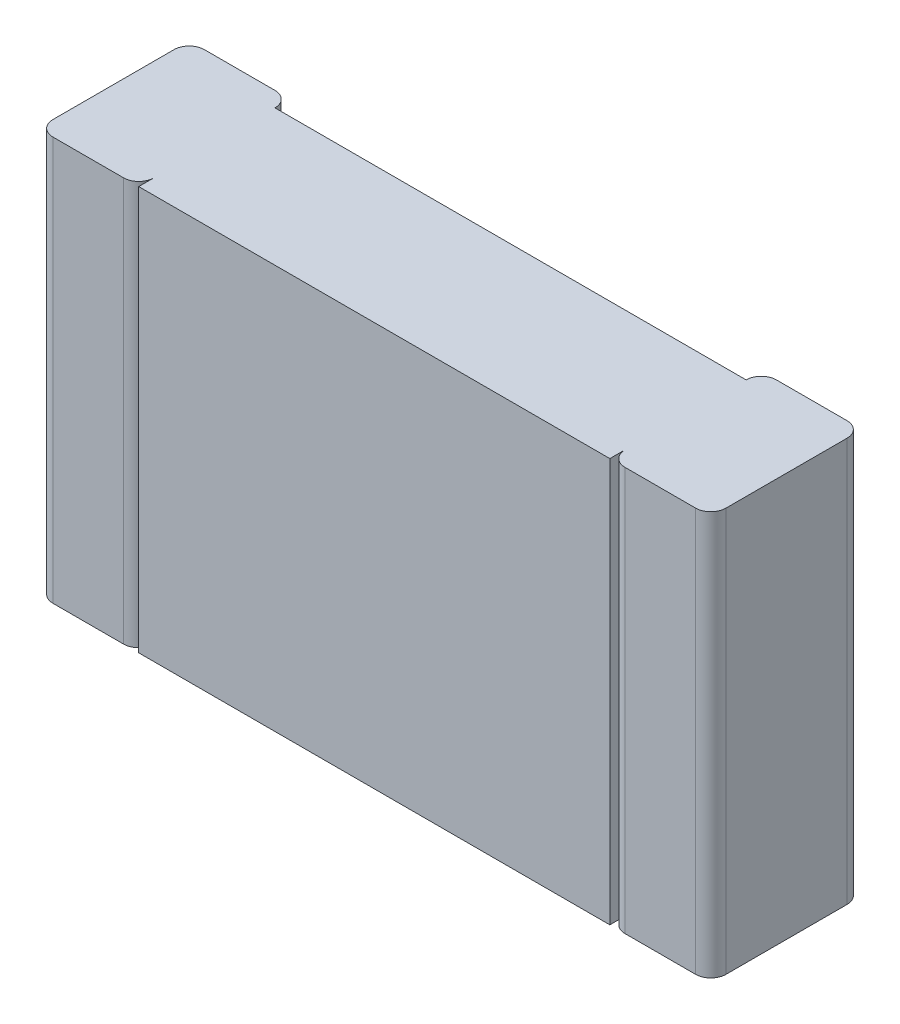
ISO-10303-21;
HEADER;
FILE_DESCRIPTION(('STEP AP214'),'2;1');
FILE_NAME('part.step','',(''),(''),'','','');
FILE_SCHEMA(('AUTOMOTIVE_DESIGN { 1 0 10303 214 1 1 1 1 }'));
ENDSEC;
DATA;
#1=APPLICATION_CONTEXT('core data for automotive mechanical design processes');
#2=APPLICATION_PROTOCOL_DEFINITION('international standard','automotive_design',2000,#1);
#3=PRODUCT_CONTEXT('',#1,'mechanical');
#4=PRODUCT('Part','Part','',(#3));
#5=PRODUCT_RELATED_PRODUCT_CATEGORY('part','',(#4));
#6=PRODUCT_DEFINITION_FORMATION('','',#4);
#7=PRODUCT_DEFINITION_CONTEXT('part definition',#1,'design');
#8=PRODUCT_DEFINITION('design','',#6,#7);
#9=PRODUCT_DEFINITION_SHAPE('','',#8);
#10=(LENGTH_UNIT() NAMED_UNIT(*) SI_UNIT(.MILLI.,.METRE.));
#11=(NAMED_UNIT(*) PLANE_ANGLE_UNIT() SI_UNIT($,.RADIAN.));
#12=(NAMED_UNIT(*) SI_UNIT($,.STERADIAN.) SOLID_ANGLE_UNIT());
#13=UNCERTAINTY_MEASURE_WITH_UNIT(LENGTH_MEASURE(1.E-05),#10,'distance_accuracy_value','');
#14=(GEOMETRIC_REPRESENTATION_CONTEXT(3) GLOBAL_UNCERTAINTY_ASSIGNED_CONTEXT((#13)) GLOBAL_UNIT_ASSIGNED_CONTEXT((#10,
#11,#12)) REPRESENTATION_CONTEXT('',''));
#15=CARTESIAN_POINT('',(0.,0.,0.));
#16=DIRECTION('',(0.,0.,1.));
#17=DIRECTION('',(1.,0.,0.));
#18=AXIS2_PLACEMENT_3D('',#15,#16,#17);
#19=CARTESIAN_POINT('',(-0.955,-0.6,0.045));
#20=DIRECTION('',(0.,1.,0.));
#21=DIRECTION('',(0.,0.,1.));
#22=AXIS2_PLACEMENT_3D('',#19,#20,#21);
#23=CYLINDRICAL_SURFACE('',#22,0.045);
#24=DIRECTION('',(0.,1.,0.));
#25=VECTOR('',#24,1.);
#26=CARTESIAN_POINT('',(-0.955,-0.6,0.));
#27=LINE('',#26,#25);
#28=CARTESIAN_POINT('',(-0.955,0.6,0.));
#29=VERTEX_POINT('',#28);
#30=CARTESIAN_POINT('',(-0.955,-0.6,0.));
#31=VERTEX_POINT('',#30);
#32=EDGE_CURVE('E128',#29,#31,#27,.F.);
#33=ORIENTED_EDGE('',*,*,#32,.T.);
#34=CARTESIAN_POINT('',(-0.955,-0.6,0.045));
#35=DIRECTION('',(0.,1.,0.));
#36=DIRECTION('',(0.,0.,1.));
#37=AXIS2_PLACEMENT_3D('',#34,#35,#36);
#38=CIRCLE('',#37,0.045);
#39=CARTESIAN_POINT('',(-1.,-0.6,0.045));
#40=VERTEX_POINT('',#39);
#41=EDGE_CURVE('E19',#31,#40,#38,.T.);
#42=ORIENTED_EDGE('',*,*,#41,.T.);
#43=DIRECTION('',(0.,1.,0.));
#44=VECTOR('',#43,1.);
#45=CARTESIAN_POINT('',(-1.,-0.6,0.045));
#46=LINE('',#45,#44);
#47=CARTESIAN_POINT('',(-1.,0.6,0.045));
#48=VERTEX_POINT('',#47);
#49=EDGE_CURVE('E135',#40,#48,#46,.T.);
#50=ORIENTED_EDGE('',*,*,#49,.T.);
#51=CARTESIAN_POINT('',(-0.955,0.6,0.045));
#52=DIRECTION('',(0.,1.,0.));
#53=DIRECTION('',(0.,0.,1.));
#54=AXIS2_PLACEMENT_3D('',#51,#52,#53);
#55=CIRCLE('',#54,0.045);
#56=EDGE_CURVE('E231',#29,#48,#55,.T.);
#57=ORIENTED_EDGE('',*,*,#56,.F.);
#58=EDGE_LOOP('',(#33,#42,#50,#57));
#59=FACE_BOUND('',#58,.T.);
#60=ADVANCED_FACE('F16',(#59),#23,.T.);
#61=CARTESIAN_POINT('',(-1.,-0.6,0.));
#62=DIRECTION('',(1.,0.,0.));
#63=DIRECTION('',(0.,0.,-1.));
#64=AXIS2_PLACEMENT_3D('',#61,#62,#63);
#65=PLANE('',#64);
#66=DIRECTION('',(0.,0.,1.));
#67=VECTOR('',#66,1.);
#68=CARTESIAN_POINT('',(-1.,0.6,0.));
#69=LINE('',#68,#67);
#70=CARTESIAN_POINT('',(-1.,0.6,0.405));
#71=VERTEX_POINT('',#70);
#72=EDGE_CURVE('E140',#48,#71,#69,.T.);
#73=ORIENTED_EDGE('',*,*,#72,.F.);
#74=ORIENTED_EDGE('',*,*,#49,.F.);
#75=DIRECTION('',(0.,0.,1.));
#76=VECTOR('',#75,1.);
#77=CARTESIAN_POINT('',(-1.,-0.6,0.));
#78=LINE('',#77,#76);
#79=CARTESIAN_POINT('',(-1.,-0.6,0.405));
#80=VERTEX_POINT('',#79);
#81=EDGE_CURVE('E139',#40,#80,#78,.T.);
#82=ORIENTED_EDGE('',*,*,#81,.T.);
#83=DIRECTION('',(0.,1.,0.));
#84=VECTOR('',#83,1.);
#85=CARTESIAN_POINT('',(-1.,-0.6,0.405));
#86=LINE('',#85,#84);
#87=EDGE_CURVE('E141',#71,#80,#86,.F.);
#88=ORIENTED_EDGE('',*,*,#87,.F.);
#89=EDGE_LOOP('',(#73,#74,#82,#88));
#90=FACE_BOUND('',#89,.T.);
#91=ADVANCED_FACE('F137',(#90),#65,.F.);
#92=CARTESIAN_POINT('',(-0.955,-0.6,0.405));
#93=DIRECTION('',(0.,1.,0.));
#94=DIRECTION('',(0.,0.,1.));
#95=AXIS2_PLACEMENT_3D('',#92,#93,#94);
#96=CYLINDRICAL_SURFACE('',#95,0.045);
#97=CARTESIAN_POINT('',(-0.955,0.6,0.405));
#98=DIRECTION('',(0.,1.,0.));
#99=DIRECTION('',(0.,0.,1.));
#100=AXIS2_PLACEMENT_3D('',#97,#98,#99);
#101=CIRCLE('',#100,0.045);
#102=CARTESIAN_POINT('',(-0.955,0.6,0.45));
#103=VERTEX_POINT('',#102);
#104=EDGE_CURVE('E229',#71,#103,#101,.T.);
#105=ORIENTED_EDGE('',*,*,#104,.F.);
#106=ORIENTED_EDGE('',*,*,#87,.T.);
#107=CARTESIAN_POINT('',(-0.955,-0.6,0.405));
#108=DIRECTION('',(0.,1.,0.));
#109=DIRECTION('',(0.,0.,1.));
#110=AXIS2_PLACEMENT_3D('',#107,#108,#109);
#111=CIRCLE('',#110,0.045);
#112=CARTESIAN_POINT('',(-0.955,-0.6,0.45));
#113=VERTEX_POINT('',#112);
#114=EDGE_CURVE('E150',#80,#113,#111,.T.);
#115=ORIENTED_EDGE('',*,*,#114,.T.);
#116=DIRECTION('',(0.,1.,0.));
#117=VECTOR('',#116,1.);
#118=CARTESIAN_POINT('',(-0.955,-0.6,0.45));
#119=LINE('',#118,#117);
#120=EDGE_CURVE('E199',#103,#113,#119,.F.);
#121=ORIENTED_EDGE('',*,*,#120,.F.);
#122=EDGE_LOOP('',(#105,#106,#115,#121));
#123=FACE_BOUND('',#122,.T.);
#124=ADVANCED_FACE('F457',(#123),#96,.T.);
#125=CARTESIAN_POINT('',(-1.,-0.6,0.45));
#126=DIRECTION('',(0.,0.,1.));
#127=DIRECTION('',(1.,0.,0.));
#128=AXIS2_PLACEMENT_3D('',#125,#126,#127);
#129=PLANE('',#128);
#130=DIRECTION('',(1.,0.,0.));
#131=VECTOR('',#130,1.);
#132=CARTESIAN_POINT('',(-1.,-0.6,0.45));
#133=LINE('',#132,#131);
#134=CARTESIAN_POINT('',(-0.745,-0.6,0.45));
#135=VERTEX_POINT('',#134);
#136=EDGE_CURVE('E247',#113,#135,#133,.T.);
#137=ORIENTED_EDGE('',*,*,#136,.T.);
#138=DIRECTION('',(0.,1.,0.));
#139=VECTOR('',#138,1.);
#140=CARTESIAN_POINT('',(-0.745,-0.6,0.45));
#141=LINE('',#140,#139);
#142=CARTESIAN_POINT('',(-0.745,0.6,0.45));
#143=VERTEX_POINT('',#142);
#144=EDGE_CURVE('E197',#143,#135,#141,.F.);
#145=ORIENTED_EDGE('',*,*,#144,.F.);
#146=DIRECTION('',(1.,0.,0.));
#147=VECTOR('',#146,1.);
#148=CARTESIAN_POINT('',(-1.,0.6,0.45));
#149=LINE('',#148,#147);
#150=EDGE_CURVE('E228',#103,#143,#149,.T.);
#151=ORIENTED_EDGE('',*,*,#150,.F.);
#152=ORIENTED_EDGE('',*,*,#120,.T.);
#153=EDGE_LOOP('',(#137,#145,#151,#152));
#154=FACE_BOUND('',#153,.T.);
#155=ADVANCED_FACE('F447',(#154),#129,.T.);
#156=CARTESIAN_POINT('',(-0.745,-0.6,0.405));
#157=DIRECTION('',(0.,1.,0.));
#158=DIRECTION('',(0.,0.,1.));
#159=AXIS2_PLACEMENT_3D('',#156,#157,#158);
#160=CYLINDRICAL_SURFACE('',#159,0.045);
#161=ORIENTED_EDGE('',*,*,#144,.T.);
#162=CARTESIAN_POINT('',(-0.745,-0.6,0.405));
#163=DIRECTION('',(0.,1.,0.));
#164=DIRECTION('',(0.,0.,1.));
#165=AXIS2_PLACEMENT_3D('',#162,#163,#164);
#166=CIRCLE('',#165,0.045);
#167=CARTESIAN_POINT('',(-0.7,-0.6,0.405));
#168=VERTEX_POINT('',#167);
#169=EDGE_CURVE('E245',#135,#168,#166,.T.);
#170=ORIENTED_EDGE('',*,*,#169,.T.);
#171=DIRECTION('',(0.,1.,0.));
#172=VECTOR('',#171,1.);
#173=CARTESIAN_POINT('',(-0.7,-0.6,0.405));
#174=LINE('',#173,#172);
#175=CARTESIAN_POINT('',(-0.7,0.6,0.405));
#176=VERTEX_POINT('',#175);
#177=EDGE_CURVE('E192',#168,#176,#174,.T.);
#178=ORIENTED_EDGE('',*,*,#177,.T.);
#179=CARTESIAN_POINT('',(-0.745,0.6,0.405));
#180=DIRECTION('',(0.,1.,0.));
#181=DIRECTION('',(0.,0.,1.));
#182=AXIS2_PLACEMENT_3D('',#179,#180,#181);
#183=CIRCLE('',#182,0.045);
#184=EDGE_CURVE('E226',#143,#176,#183,.T.);
#185=ORIENTED_EDGE('',*,*,#184,.F.);
#186=EDGE_LOOP('',(#161,#170,#178,#185));
#187=FACE_BOUND('',#186,.T.);
#188=ADVANCED_FACE('F435',(#187),#160,.T.);
#189=CARTESIAN_POINT('',(-0.7,-0.6,0.405));
#190=DIRECTION('',(1.,0.,0.));
#191=DIRECTION('',(0.,0.,-1.));
#192=AXIS2_PLACEMENT_3D('',#189,#190,#191);
#193=PLANE('',#192);
#194=DIRECTION('',(0.,0.,1.));
#195=VECTOR('',#194,1.);
#196=CARTESIAN_POINT('',(-0.7,0.6,0.405));
#197=LINE('',#196,#195);
#198=CARTESIAN_POINT('',(-0.7,0.6,0.45));
#199=VERTEX_POINT('',#198);
#200=EDGE_CURVE('E187',#176,#199,#197,.T.);
#201=ORIENTED_EDGE('',*,*,#200,.F.);
#202=ORIENTED_EDGE('',*,*,#177,.F.);
#203=DIRECTION('',(0.,0.,1.));
#204=VECTOR('',#203,1.);
#205=CARTESIAN_POINT('',(-0.7,-0.6,0.405));
#206=LINE('',#205,#204);
#207=CARTESIAN_POINT('',(-0.7,-0.6,0.45));
#208=VERTEX_POINT('',#207);
#209=EDGE_CURVE('E205',#168,#208,#206,.T.);
#210=ORIENTED_EDGE('',*,*,#209,.T.);
#211=DIRECTION('',(0.,1.,0.));
#212=VECTOR('',#211,1.);
#213=CARTESIAN_POINT('',(-0.7,-0.6,0.45));
#214=LINE('',#213,#212);
#215=EDGE_CURVE('E180',#199,#208,#214,.F.);
#216=ORIENTED_EDGE('',*,*,#215,.F.);
#217=EDGE_LOOP('',(#201,#202,#210,#216));
#218=FACE_BOUND('',#217,.T.);
#219=ADVANCED_FACE('F425',(#218),#193,.F.);
#220=CARTESIAN_POINT('',(-0.7,-0.6,0.45));
#221=DIRECTION('',(0.,0.,1.));
#222=DIRECTION('',(1.,0.,0.));
#223=AXIS2_PLACEMENT_3D('',#220,#221,#222);
#224=PLANE('',#223);
#225=DIRECTION('',(0.,1.,0.));
#226=VECTOR('',#225,1.);
#227=CARTESIAN_POINT('',(0.7,-0.6,0.45));
#228=LINE('',#227,#226);
#229=CARTESIAN_POINT('',(0.7,0.6,0.45));
#230=VERTEX_POINT('',#229);
#231=CARTESIAN_POINT('',(0.7,-0.6,0.45));
#232=VERTEX_POINT('',#231);
#233=EDGE_CURVE('E173',#230,#232,#228,.F.);
#234=ORIENTED_EDGE('',*,*,#233,.F.);
#235=DIRECTION('',(1.,0.,0.));
#236=VECTOR('',#235,1.);
#237=CARTESIAN_POINT('',(-0.7,0.6,0.45));
#238=LINE('',#237,#236);
#239=EDGE_CURVE('E183',#199,#230,#238,.T.);
#240=ORIENTED_EDGE('',*,*,#239,.F.);
#241=ORIENTED_EDGE('',*,*,#215,.T.);
#242=DIRECTION('',(1.,0.,0.));
#243=VECTOR('',#242,1.);
#244=CARTESIAN_POINT('',(-0.7,-0.6,0.45));
#245=LINE('',#244,#243);
#246=EDGE_CURVE('E202',#208,#232,#245,.T.);
#247=ORIENTED_EDGE('',*,*,#246,.T.);
#248=EDGE_LOOP('',(#234,#240,#241,#247));
#249=FACE_BOUND('',#248,.T.);
#250=ADVANCED_FACE('F412',(#249),#224,.T.);
#251=CARTESIAN_POINT('',(0.7,-0.6,0.405));
#252=DIRECTION('',(1.,0.,0.));
#253=DIRECTION('',(0.,0.,-1.));
#254=AXIS2_PLACEMENT_3D('',#251,#252,#253);
#255=PLANE('',#254);
#256=DIRECTION('',(0.,0.,1.));
#257=VECTOR('',#256,1.);
#258=CARTESIAN_POINT('',(0.7,0.6,0.405));
#259=LINE('',#258,#257);
#260=CARTESIAN_POINT('',(0.7,0.6,0.405));
#261=VERTEX_POINT('',#260);
#262=EDGE_CURVE('E186',#230,#261,#259,.F.);
#263=ORIENTED_EDGE('',*,*,#262,.F.);
#264=ORIENTED_EDGE('',*,*,#233,.T.);
#265=DIRECTION('',(0.,0.,1.));
#266=VECTOR('',#265,1.);
#267=CARTESIAN_POINT('',(0.7,-0.6,0.405));
#268=LINE('',#267,#266);
#269=CARTESIAN_POINT('',(0.7,-0.6,0.405));
#270=VERTEX_POINT('',#269);
#271=EDGE_CURVE('E177',#232,#270,#268,.F.);
#272=ORIENTED_EDGE('',*,*,#271,.T.);
#273=DIRECTION('',(0.,1.,0.));
#274=VECTOR('',#273,1.);
#275=CARTESIAN_POINT('',(0.7,-0.6,0.405));
#276=LINE('',#275,#274);
#277=EDGE_CURVE('E171',#261,#270,#276,.F.);
#278=ORIENTED_EDGE('',*,*,#277,.F.);
#279=EDGE_LOOP('',(#263,#264,#272,#278));
#280=FACE_BOUND('',#279,.T.);
#281=ADVANCED_FACE('F376',(#280),#255,.T.);
#282=CARTESIAN_POINT('',(0.745,-0.6,0.405));
#283=DIRECTION('',(0.,1.,0.));
#284=DIRECTION('',(0.,0.,1.));
#285=AXIS2_PLACEMENT_3D('',#282,#283,#284);
#286=CYLINDRICAL_SURFACE('',#285,0.045);
#287=CARTESIAN_POINT('',(0.745,0.6,0.405));
#288=DIRECTION('',(0.,1.,0.));
#289=DIRECTION('',(0.,0.,1.));
#290=AXIS2_PLACEMENT_3D('',#287,#288,#289);
#291=CIRCLE('',#290,0.045);
#292=CARTESIAN_POINT('',(0.745,0.6,0.45));
#293=VERTEX_POINT('',#292);
#294=EDGE_CURVE('E223',#261,#293,#291,.T.);
#295=ORIENTED_EDGE('',*,*,#294,.F.);
#296=ORIENTED_EDGE('',*,*,#277,.T.);
#297=CARTESIAN_POINT('',(0.745,-0.6,0.405));
#298=DIRECTION('',(0.,1.,0.));
#299=DIRECTION('',(0.,0.,1.));
#300=AXIS2_PLACEMENT_3D('',#297,#298,#299);
#301=CIRCLE('',#300,0.045);
#302=CARTESIAN_POINT('',(0.745,-0.6,0.45));
#303=VERTEX_POINT('',#302);
#304=EDGE_CURVE('E242',#270,#303,#301,.T.);
#305=ORIENTED_EDGE('',*,*,#304,.T.);
#306=DIRECTION('',(0.,1.,0.));
#307=VECTOR('',#306,1.);
#308=CARTESIAN_POINT('',(0.745,-0.6,0.45));
#309=LINE('',#308,#307);
#310=EDGE_CURVE('E169',#293,#303,#309,.F.);
#311=ORIENTED_EDGE('',*,*,#310,.F.);
#312=EDGE_LOOP('',(#295,#296,#305,#311));
#313=FACE_BOUND('',#312,.T.);
#314=ADVANCED_FACE('F411',(#313),#286,.T.);
#315=CARTESIAN_POINT('',(0.7,-0.6,0.45));
#316=DIRECTION('',(0.,0.,1.));
#317=DIRECTION('',(1.,0.,0.));
#318=AXIS2_PLACEMENT_3D('',#315,#316,#317);
#319=PLANE('',#318);
#320=DIRECTION('',(1.,0.,0.));
#321=VECTOR('',#320,1.);
#322=CARTESIAN_POINT('',(0.7,-0.6,0.45));
#323=LINE('',#322,#321);
#324=CARTESIAN_POINT('',(0.955,-0.6,0.45));
#325=VERTEX_POINT('',#324);
#326=EDGE_CURVE('E241',#303,#325,#323,.T.);
#327=ORIENTED_EDGE('',*,*,#326,.T.);
#328=DIRECTION('',(0.,1.,0.));
#329=VECTOR('',#328,1.);
#330=CARTESIAN_POINT('',(0.955,-0.6,0.45));
#331=LINE('',#330,#329);
#332=CARTESIAN_POINT('',(0.955,0.6,0.45));
#333=VERTEX_POINT('',#332);
#334=EDGE_CURVE('E167',#333,#325,#331,.F.);
#335=ORIENTED_EDGE('',*,*,#334,.F.);
#336=DIRECTION('',(1.,0.,0.));
#337=VECTOR('',#336,1.);
#338=CARTESIAN_POINT('',(0.7,0.6,0.45));
#339=LINE('',#338,#337);
#340=EDGE_CURVE('E222',#293,#333,#339,.T.);
#341=ORIENTED_EDGE('',*,*,#340,.F.);
#342=ORIENTED_EDGE('',*,*,#310,.T.);
#343=EDGE_LOOP('',(#327,#335,#341,#342));
#344=FACE_BOUND('',#343,.T.);
#345=ADVANCED_FACE('F488',(#344),#319,.T.);
#346=CARTESIAN_POINT('',(0.955,-0.6,0.405));
#347=DIRECTION('',(0.,1.,0.));
#348=DIRECTION('',(0.,0.,1.));
#349=AXIS2_PLACEMENT_3D('',#346,#347,#348);
#350=CYLINDRICAL_SURFACE('',#349,0.045);
#351=ORIENTED_EDGE('',*,*,#334,.T.);
#352=CARTESIAN_POINT('',(0.955,-0.6,0.405));
#353=DIRECTION('',(0.,1.,0.));
#354=DIRECTION('',(0.,0.,1.));
#355=AXIS2_PLACEMENT_3D('',#352,#353,#354);
#356=CIRCLE('',#355,0.045);
#357=CARTESIAN_POINT('',(1.,-0.6,0.405));
#358=VERTEX_POINT('',#357);
#359=EDGE_CURVE('E238',#325,#358,#356,.T.);
#360=ORIENTED_EDGE('',*,*,#359,.T.);
#361=DIRECTION('',(0.,1.,0.));
#362=VECTOR('',#361,1.);
#363=CARTESIAN_POINT('',(1.,-0.6,0.405));
#364=LINE('',#363,#362);
#365=CARTESIAN_POINT('',(1.,0.6,0.405));
#366=VERTEX_POINT('',#365);
#367=EDGE_CURVE('E165',#366,#358,#364,.F.);
#368=ORIENTED_EDGE('',*,*,#367,.F.);
#369=CARTESIAN_POINT('',(0.955,0.6,0.405));
#370=DIRECTION('',(0.,1.,0.));
#371=DIRECTION('',(0.,0.,1.));
#372=AXIS2_PLACEMENT_3D('',#369,#370,#371);
#373=CIRCLE('',#372,0.045);
#374=EDGE_CURVE('E220',#333,#366,#373,.T.);
#375=ORIENTED_EDGE('',*,*,#374,.F.);
#376=EDGE_LOOP('',(#351,#360,#368,#375));
#377=FACE_BOUND('',#376,.T.);
#378=ADVANCED_FACE('F492',(#377),#350,.T.);
#379=CARTESIAN_POINT('',(1.,-0.6,0.));
#380=DIRECTION('',(1.,0.,0.));
#381=DIRECTION('',(0.,0.,-1.));
#382=AXIS2_PLACEMENT_3D('',#379,#380,#381);
#383=PLANE('',#382);
#384=DIRECTION('',(0.,0.,1.));
#385=VECTOR('',#384,1.);
#386=CARTESIAN_POINT('',(1.,0.6,0.));
#387=LINE('',#386,#385);
#388=CARTESIAN_POINT('',(1.,0.6,0.045));
#389=VERTEX_POINT('',#388);
#390=EDGE_CURVE('E219',#366,#389,#387,.F.);
#391=ORIENTED_EDGE('',*,*,#390,.F.);
#392=ORIENTED_EDGE('',*,*,#367,.T.);
#393=DIRECTION('',(0.,0.,1.));
#394=VECTOR('',#393,1.);
#395=CARTESIAN_POINT('',(1.,-0.6,0.));
#396=LINE('',#395,#394);
#397=CARTESIAN_POINT('',(1.,-0.6,0.045));
#398=VERTEX_POINT('',#397);
#399=EDGE_CURVE('E237',#358,#398,#396,.F.);
#400=ORIENTED_EDGE('',*,*,#399,.T.);
#401=DIRECTION('',(0.,1.,0.));
#402=VECTOR('',#401,1.);
#403=CARTESIAN_POINT('',(1.,-0.6,0.045));
#404=LINE('',#403,#402);
#405=EDGE_CURVE('E156',#389,#398,#404,.F.);
#406=ORIENTED_EDGE('',*,*,#405,.F.);
#407=EDGE_LOOP('',(#391,#392,#400,#406));
#408=FACE_BOUND('',#407,.T.);
#409=ADVANCED_FACE('F297',(#408),#383,.T.);
#410=CARTESIAN_POINT('',(0.955,-0.6,0.045));
#411=DIRECTION('',(0.,1.,0.));
#412=DIRECTION('',(0.,0.,1.));
#413=AXIS2_PLACEMENT_3D('',#410,#411,#412);
#414=CYLINDRICAL_SURFACE('',#413,0.045);
#415=CARTESIAN_POINT('',(0.955,0.6,0.045));
#416=DIRECTION('',(0.,1.,0.));
#417=DIRECTION('',(0.,0.,1.));
#418=AXIS2_PLACEMENT_3D('',#415,#416,#417);
#419=CIRCLE('',#418,0.045);
#420=CARTESIAN_POINT('',(0.955,0.6,0.));
#421=VERTEX_POINT('',#420);
#422=EDGE_CURVE('E216',#389,#421,#419,.T.);
#423=ORIENTED_EDGE('',*,*,#422,.F.);
#424=ORIENTED_EDGE('',*,*,#405,.T.);
#425=CARTESIAN_POINT('',(0.955,-0.6,0.045));
#426=DIRECTION('',(0.,1.,0.));
#427=DIRECTION('',(0.,0.,1.));
#428=AXIS2_PLACEMENT_3D('',#425,#426,#427);
#429=CIRCLE('',#428,0.045);
#430=CARTESIAN_POINT('',(0.955,-0.6,0.));
#431=VERTEX_POINT('',#430);
#432=EDGE_CURVE('E234',#398,#431,#429,.T.);
#433=ORIENTED_EDGE('',*,*,#432,.T.);
#434=DIRECTION('',(0.,1.,0.));
#435=VECTOR('',#434,1.);
#436=CARTESIAN_POINT('',(0.955,-0.6,0.));
#437=LINE('',#436,#435);
#438=EDGE_CURVE('E174',#431,#421,#437,.T.);
#439=ORIENTED_EDGE('',*,*,#438,.T.);
#440=EDGE_LOOP('',(#423,#424,#433,#439));
#441=FACE_BOUND('',#440,.T.);
#442=ADVANCED_FACE('F301',(#441),#414,.T.);
#443=CARTESIAN_POINT('',(-1.,-0.6,0.));
#444=DIRECTION('',(0.,0.,1.));
#445=DIRECTION('',(1.,0.,0.));
#446=AXIS2_PLACEMENT_3D('',#443,#444,#445);
#447=PLANE('',#446);
#448=DIRECTION('',(1.,0.,0.));
#449=VECTOR('',#448,1.);
#450=CARTESIAN_POINT('',(-1.,-0.6,0.));
#451=LINE('',#450,#449);
#452=CARTESIAN_POINT('',(-0.745,-0.6,0.));
#453=VERTEX_POINT('',#452);
#454=EDGE_CURVE('E152',#453,#31,#451,.F.);
#455=ORIENTED_EDGE('',*,*,#454,.T.);
#456=ORIENTED_EDGE('',*,*,#32,.F.);
#457=DIRECTION('',(1.,0.,0.));
#458=VECTOR('',#457,1.);
#459=CARTESIAN_POINT('',(-1.,0.6,0.));
#460=LINE('',#459,#458);
#461=CARTESIAN_POINT('',(-0.745,0.6,0.));
#462=VERTEX_POINT('',#461);
#463=EDGE_CURVE('E233',#462,#29,#460,.F.);
#464=ORIENTED_EDGE('',*,*,#463,.F.);
#465=DIRECTION('',(0.,1.,0.));
#466=VECTOR('',#465,1.);
#467=CARTESIAN_POINT('',(-0.745,-0.6,0.));
#468=LINE('',#467,#466);
#469=EDGE_CURVE('E160',#453,#462,#468,.T.);
#470=ORIENTED_EDGE('',*,*,#469,.F.);
#471=EDGE_LOOP('',(#455,#456,#464,#470));
#472=FACE_BOUND('',#471,.T.);
#473=ADVANCED_FACE('F318',(#472),#447,.F.);
#474=CARTESIAN_POINT('',(0.7,-0.6,0.));
#475=DIRECTION('',(0.,0.,1.));
#476=DIRECTION('',(1.,0.,0.));
#477=AXIS2_PLACEMENT_3D('',#474,#475,#476);
#478=PLANE('',#477);
#479=DIRECTION('',(1.,0.,0.));
#480=VECTOR('',#479,1.);
#481=CARTESIAN_POINT('',(0.7,-0.6,0.));
#482=LINE('',#481,#480);
#483=CARTESIAN_POINT('',(0.745,-0.6,0.));
#484=VERTEX_POINT('',#483);
#485=EDGE_CURVE('E176',#431,#484,#482,.F.);
#486=ORIENTED_EDGE('',*,*,#485,.T.);
#487=DIRECTION('',(0.,1.,0.));
#488=VECTOR('',#487,1.);
#489=CARTESIAN_POINT('',(0.745,-0.6,0.));
#490=LINE('',#489,#488);
#491=CARTESIAN_POINT('',(0.745,0.6,0.));
#492=VERTEX_POINT('',#491);
#493=EDGE_CURVE('E211',#492,#484,#490,.F.);
#494=ORIENTED_EDGE('',*,*,#493,.F.);
#495=DIRECTION('',(1.,0.,0.));
#496=VECTOR('',#495,1.);
#497=CARTESIAN_POINT('',(0.7,0.6,0.));
#498=LINE('',#497,#496);
#499=EDGE_CURVE('E225',#421,#492,#498,.F.);
#500=ORIENTED_EDGE('',*,*,#499,.F.);
#501=ORIENTED_EDGE('',*,*,#438,.F.);
#502=EDGE_LOOP('',(#486,#494,#500,#501));
#503=FACE_BOUND('',#502,.T.);
#504=ADVANCED_FACE('F304',(#503),#478,.F.);
#505=CARTESIAN_POINT('',(-0.745,-0.6,0.045));
#506=DIRECTION('',(0.,1.,0.));
#507=DIRECTION('',(0.,0.,1.));
#508=AXIS2_PLACEMENT_3D('',#505,#506,#507);
#509=CYLINDRICAL_SURFACE('',#508,0.045);
#510=CARTESIAN_POINT('',(-0.745,0.6,0.045));
#511=DIRECTION('',(0.,1.,0.));
#512=DIRECTION('',(0.,0.,1.));
#513=AXIS2_PLACEMENT_3D('',#510,#511,#512);
#514=CIRCLE('',#513,0.045);
#515=CARTESIAN_POINT('',(-0.7,0.6,0.045));
#516=VERTEX_POINT('',#515);
#517=EDGE_CURVE('E162',#462,#516,#514,.F.);
#518=ORIENTED_EDGE('',*,*,#517,.T.);
#519=DIRECTION('',(0.,1.,0.));
#520=VECTOR('',#519,1.);
#521=CARTESIAN_POINT('',(-0.7,-0.6,0.045));
#522=LINE('',#521,#520);
#523=CARTESIAN_POINT('',(-0.7,-0.6,0.045));
#524=VERTEX_POINT('',#523);
#525=EDGE_CURVE('E210',#516,#524,#522,.F.);
#526=ORIENTED_EDGE('',*,*,#525,.T.);
#527=CARTESIAN_POINT('',(-0.745,-0.6,0.045));
#528=DIRECTION('',(0.,1.,0.));
#529=DIRECTION('',(0.,0.,1.));
#530=AXIS2_PLACEMENT_3D('',#527,#528,#529);
#531=CIRCLE('',#530,0.045);
#532=EDGE_CURVE('E163',#524,#453,#531,.T.);
#533=ORIENTED_EDGE('',*,*,#532,.T.);
#534=ORIENTED_EDGE('',*,*,#469,.T.);
#535=EDGE_LOOP('',(#518,#526,#533,#534));
#536=FACE_BOUND('',#535,.T.);
#537=ADVANCED_FACE('F317',(#536),#509,.T.);
#538=CARTESIAN_POINT('',(-0.955,-0.6,0.045));
#539=DIRECTION('',(0.,1.,0.));
#540=DIRECTION('',(0.,0.,1.));
#541=AXIS2_PLACEMENT_3D('',#538,#539,#540);
#542=PLANE('',#541);
#543=DIRECTION('',(1.,0.,0.));
#544=VECTOR('',#543,1.);
#545=CARTESIAN_POINT('',(-0.955,-0.6,0.045));
#546=LINE('',#545,#544);
#547=CARTESIAN_POINT('',(0.7,-0.6,0.045));
#548=VERTEX_POINT('',#547);
#549=EDGE_CURVE('E262',#524,#548,#546,.T.);
#550=ORIENTED_EDGE('',*,*,#549,.T.);
#551=CARTESIAN_POINT('',(0.745,-0.6,0.045));
#552=DIRECTION('',(0.,1.,0.));
#553=DIRECTION('',(0.,0.,1.));
#554=AXIS2_PLACEMENT_3D('',#551,#552,#553);
#555=CIRCLE('',#554,0.045);
#556=EDGE_CURVE('E208',#484,#548,#555,.T.);
#557=ORIENTED_EDGE('',*,*,#556,.F.);
#558=ORIENTED_EDGE('',*,*,#485,.F.);
#559=ORIENTED_EDGE('',*,*,#432,.F.);
#560=ORIENTED_EDGE('',*,*,#399,.F.);
#561=ORIENTED_EDGE('',*,*,#359,.F.);
#562=ORIENTED_EDGE('',*,*,#326,.F.);
#563=ORIENTED_EDGE('',*,*,#304,.F.);
#564=ORIENTED_EDGE('',*,*,#271,.F.);
#565=ORIENTED_EDGE('',*,*,#246,.F.);
#566=ORIENTED_EDGE('',*,*,#209,.F.);
#567=ORIENTED_EDGE('',*,*,#169,.F.);
#568=ORIENTED_EDGE('',*,*,#136,.F.);
#569=ORIENTED_EDGE('',*,*,#114,.F.);
#570=ORIENTED_EDGE('',*,*,#81,.F.);
#571=ORIENTED_EDGE('',*,*,#41,.F.);
#572=ORIENTED_EDGE('',*,*,#454,.F.);
#573=ORIENTED_EDGE('',*,*,#532,.F.);
#574=EDGE_LOOP('',(#550,#557,#558,#559,#560,#561,#562,#563,#564,#565,#566,#567,#568,#569,#570,
#571,#572,#573));
#575=FACE_BOUND('',#574,.T.);
#576=ADVANCED_FACE('F146',(#575),#542,.F.);
#577=CARTESIAN_POINT('',(0.745,-0.6,0.045));
#578=DIRECTION('',(0.,1.,0.));
#579=DIRECTION('',(0.,0.,1.));
#580=AXIS2_PLACEMENT_3D('',#577,#578,#579);
#581=CYLINDRICAL_SURFACE('',#580,0.045);
#582=ORIENTED_EDGE('',*,*,#493,.T.);
#583=ORIENTED_EDGE('',*,*,#556,.T.);
#584=DIRECTION('',(0.,1.,0.));
#585=VECTOR('',#584,1.);
#586=CARTESIAN_POINT('',(0.7,-0.6,0.045));
#587=LINE('',#586,#585);
#588=CARTESIAN_POINT('',(0.7,0.6,0.045));
#589=VERTEX_POINT('',#588);
#590=EDGE_CURVE('E25',#548,#589,#587,.T.);
#591=ORIENTED_EDGE('',*,*,#590,.T.);
#592=CARTESIAN_POINT('',(0.745,0.6,0.045));
#593=DIRECTION('',(0.,1.,0.));
#594=DIRECTION('',(0.,0.,1.));
#595=AXIS2_PLACEMENT_3D('',#592,#593,#594);
#596=CIRCLE('',#595,0.045);
#597=EDGE_CURVE('E33',#589,#492,#596,.F.);
#598=ORIENTED_EDGE('',*,*,#597,.T.);
#599=EDGE_LOOP('',(#582,#583,#591,#598));
#600=FACE_BOUND('',#599,.T.);
#601=ADVANCED_FACE('F310',(#600),#581,.T.);
#602=CARTESIAN_POINT('',(-0.955,0.6,0.045));
#603=DIRECTION('',(0.,1.,0.));
#604=DIRECTION('',(0.,0.,1.));
#605=AXIS2_PLACEMENT_3D('',#602,#603,#604);
#606=PLANE('',#605);
#607=DIRECTION('',(1.,0.,0.));
#608=VECTOR('',#607,1.);
#609=CARTESIAN_POINT('',(-0.955,0.6,0.045));
#610=LINE('',#609,#608);
#611=EDGE_CURVE('E11',#589,#516,#610,.F.);
#612=ORIENTED_EDGE('',*,*,#611,.T.);
#613=ORIENTED_EDGE('',*,*,#517,.F.);
#614=ORIENTED_EDGE('',*,*,#463,.T.);
#615=ORIENTED_EDGE('',*,*,#56,.T.);
#616=ORIENTED_EDGE('',*,*,#72,.T.);
#617=ORIENTED_EDGE('',*,*,#104,.T.);
#618=ORIENTED_EDGE('',*,*,#150,.T.);
#619=ORIENTED_EDGE('',*,*,#184,.T.);
#620=ORIENTED_EDGE('',*,*,#200,.T.);
#621=ORIENTED_EDGE('',*,*,#239,.T.);
#622=ORIENTED_EDGE('',*,*,#262,.T.);
#623=ORIENTED_EDGE('',*,*,#294,.T.);
#624=ORIENTED_EDGE('',*,*,#340,.T.);
#625=ORIENTED_EDGE('',*,*,#374,.T.);
#626=ORIENTED_EDGE('',*,*,#390,.T.);
#627=ORIENTED_EDGE('',*,*,#422,.T.);
#628=ORIENTED_EDGE('',*,*,#499,.T.);
#629=ORIENTED_EDGE('',*,*,#597,.F.);
#630=EDGE_LOOP('',(#612,#613,#614,#615,#616,#617,#618,#619,#620,#621,#622,#623,#624,#625,#626,
#627,#628,#629));
#631=FACE_BOUND('',#630,.T.);
#632=ADVANCED_FACE('F291',(#631),#606,.T.);
#633=CARTESIAN_POINT('',(-0.955,-0.6,0.045));
#634=DIRECTION('',(0.,0.,1.));
#635=DIRECTION('',(1.,0.,0.));
#636=AXIS2_PLACEMENT_3D('',#633,#634,#635);
#637=PLANE('',#636);
#638=ORIENTED_EDGE('',*,*,#590,.F.);
#639=ORIENTED_EDGE('',*,*,#549,.F.);
#640=ORIENTED_EDGE('',*,*,#525,.F.);
#641=ORIENTED_EDGE('',*,*,#611,.F.);
#642=EDGE_LOOP('',(#638,#639,#640,#641));
#643=FACE_BOUND('',#642,.T.);
#644=ADVANCED_FACE('F312',(#643),#637,.F.);
#645=CLOSED_SHELL('',(#60,#91,#124,#155,#188,#219,#250,#281,#314,#345,#378,#409,#442,#473,#504,
#537,#576,#601,#632,#644));
#646=MANIFOLD_SOLID_BREP('B1',#645);
#647=ADVANCED_BREP_SHAPE_REPRESENTATION('',(#18,#646),#14);
#648=SHAPE_DEFINITION_REPRESENTATION(#9,#647);
ENDSEC;
END-ISO-10303-21;
